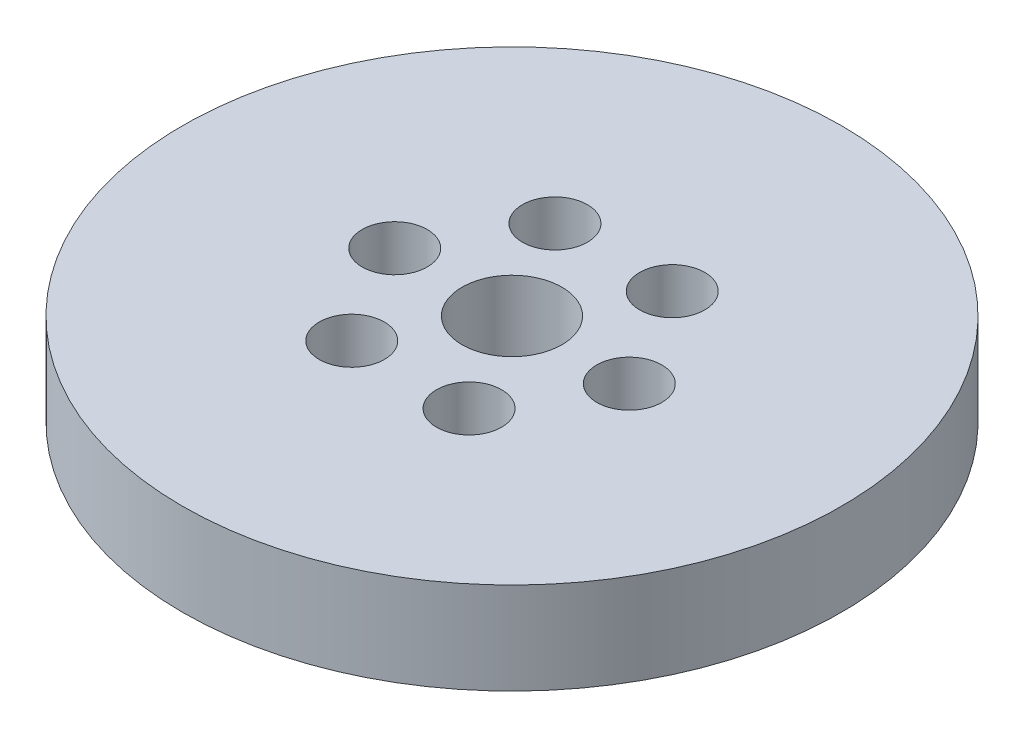
ISO-10303-21;
HEADER;
FILE_DESCRIPTION(('STEP AP214'),'2;1');
FILE_NAME('part.step','',(''),(''),'','','');
FILE_SCHEMA(('AUTOMOTIVE_DESIGN { 1 0 10303 214 1 1 1 1 }'));
ENDSEC;
DATA;
#1=APPLICATION_CONTEXT('core data for automotive mechanical design processes');
#2=APPLICATION_PROTOCOL_DEFINITION('international standard','automotive_design',2000,#1);
#3=PRODUCT_CONTEXT('',#1,'mechanical');
#4=PRODUCT('Part','Part','',(#3));
#5=PRODUCT_RELATED_PRODUCT_CATEGORY('part','',(#4));
#6=PRODUCT_DEFINITION_FORMATION('','',#4);
#7=PRODUCT_DEFINITION_CONTEXT('part definition',#1,'design');
#8=PRODUCT_DEFINITION('design','',#6,#7);
#9=PRODUCT_DEFINITION_SHAPE('','',#8);
#10=(LENGTH_UNIT() NAMED_UNIT(*) SI_UNIT(.MILLI.,.METRE.));
#11=(NAMED_UNIT(*) PLANE_ANGLE_UNIT() SI_UNIT($,.RADIAN.));
#12=(NAMED_UNIT(*) SI_UNIT($,.STERADIAN.) SOLID_ANGLE_UNIT());
#13=UNCERTAINTY_MEASURE_WITH_UNIT(LENGTH_MEASURE(1.E-05),#10,'distance_accuracy_value','');
#14=(GEOMETRIC_REPRESENTATION_CONTEXT(3) GLOBAL_UNCERTAINTY_ASSIGNED_CONTEXT((#13)) GLOBAL_UNIT_ASSIGNED_CONTEXT((#10,
#11,#12)) REPRESENTATION_CONTEXT('',''));
#15=CARTESIAN_POINT('',(0.,0.,0.));
#16=DIRECTION('',(0.,0.,1.));
#17=DIRECTION('',(1.,0.,0.));
#18=AXIS2_PLACEMENT_3D('',#15,#16,#17);
#19=CARTESIAN_POINT('',(0.,23.,0.));
#20=DIRECTION('',(0.,-1.,0.));
#21=DIRECTION('',(0.,0.,-1.));
#22=AXIS2_PLACEMENT_3D('',#19,#20,#21);
#23=CYLINDRICAL_SURFACE('',#22,82.5);
#24=CARTESIAN_POINT('',(0.,23.,0.));
#25=DIRECTION('',(0.,1.,0.));
#26=DIRECTION('',(0.,0.,1.));
#27=AXIS2_PLACEMENT_3D('',#24,#25,#26);
#28=CIRCLE('',#27,82.5);
#29=CARTESIAN_POINT('',(0.,23.,82.5));
#30=VERTEX_POINT('',#29);
#31=EDGE_CURVE('E10',#30,#30,#28,.T.);
#32=ORIENTED_EDGE('',*,*,#31,.F.);
#33=EDGE_LOOP('',(#32));
#34=FACE_BOUND('',#33,.T.);
#35=CARTESIAN_POINT('',(0.,0.,0.));
#36=DIRECTION('',(0.,1.,0.));
#37=DIRECTION('',(0.,0.,1.));
#38=AXIS2_PLACEMENT_3D('',#35,#36,#37);
#39=CIRCLE('',#38,82.5);
#40=CARTESIAN_POINT('',(0.,0.,82.5));
#41=VERTEX_POINT('',#40);
#42=EDGE_CURVE('E37',#41,#41,#39,.T.);
#43=ORIENTED_EDGE('',*,*,#42,.T.);
#44=EDGE_LOOP('',(#43));
#45=FACE_BOUND('',#44,.T.);
#46=ADVANCED_FACE('F40',(#34,#45),#23,.T.);
#47=CARTESIAN_POINT('',(0.,23.,0.));
#48=DIRECTION('',(0.,1.,0.));
#49=DIRECTION('',(0.,0.,1.));
#50=AXIS2_PLACEMENT_3D('',#47,#48,#49);
#51=PLANE('',#50);
#52=CARTESIAN_POINT('',(-14.6817229672217,23.,-25.4294901218782));
#53=DIRECTION('',(0.,1.,0.));
#54=DIRECTION('',(-0.866025403784433,0.,0.50000000000001));
#55=AXIS2_PLACEMENT_3D('',#52,#53,#54);
#56=CIRCLE('',#55,8.14547012890914);
#57=CARTESIAN_POINT('',(-21.7359070246243,23.,-21.3567550574236));
#58=VERTEX_POINT('',#57);
#59=EDGE_CURVE('E70',#58,#58,#56,.T.);
#60=ORIENTED_EDGE('',*,*,#59,.F.);
#61=EDGE_LOOP('',(#60));
#62=FACE_BOUND('',#61,.T.);
#63=CARTESIAN_POINT('',(14.6817229672212,23.,-25.4294901218785));
#64=DIRECTION('',(0.,1.,0.));
#65=DIRECTION('',(-0.866025403784443,0.,-0.499999999999992));
#66=AXIS2_PLACEMENT_3D('',#63,#64,#65);
#67=CIRCLE('',#66,8.14547012890914);
#68=CARTESIAN_POINT('',(7.62753890981853,23.,-29.502225186333));
#69=VERTEX_POINT('',#68);
#70=EDGE_CURVE('E71',#69,#69,#67,.T.);
#71=ORIENTED_EDGE('',*,*,#70,.F.);
#72=EDGE_LOOP('',(#71));
#73=FACE_BOUND('',#72,.T.);
#74=CARTESIAN_POINT('',(29.3634459344429,23.,0.));
#75=DIRECTION('',(0.,1.,0.));
#76=DIRECTION('',(0.,0.,-1.));
#77=AXIS2_PLACEMENT_3D('',#74,#75,#76);
#78=CIRCLE('',#77,8.14547012890914);
#79=CARTESIAN_POINT('',(29.3634459344429,23.,-8.14547012890914));
#80=VERTEX_POINT('',#79);
#81=EDGE_CURVE('E78',#80,#80,#78,.T.);
#82=ORIENTED_EDGE('',*,*,#81,.F.);
#83=EDGE_LOOP('',(#82));
#84=FACE_BOUND('',#83,.T.);
#85=CARTESIAN_POINT('',(14.6817229672215,23.,25.4294901218783));
#86=DIRECTION('',(0.,1.,0.));
#87=DIRECTION('',(0.866025403784436,0.,-0.500000000000004));
#88=AXIS2_PLACEMENT_3D('',#85,#86,#87);
#89=CIRCLE('',#88,8.14547012890914);
#90=CARTESIAN_POINT('',(21.7359070246242,23.,21.3567550574237));
#91=VERTEX_POINT('',#90);
#92=EDGE_CURVE('E84',#91,#91,#89,.T.);
#93=ORIENTED_EDGE('',*,*,#92,.F.);
#94=EDGE_LOOP('',(#93));
#95=FACE_BOUND('',#94,.T.);
#96=CARTESIAN_POINT('',(-14.6817229672214,23.,25.4294901218784));
#97=DIRECTION('',(0.,1.,0.));
#98=DIRECTION('',(0.86602540378444,0.,0.499999999999998));
#99=AXIS2_PLACEMENT_3D('',#96,#97,#98);
#100=CIRCLE('',#99,8.14547012890914);
#101=CARTESIAN_POINT('',(-7.62753890981874,23.,29.502225186333));
#102=VERTEX_POINT('',#101);
#103=EDGE_CURVE('E61',#102,#102,#100,.T.);
#104=ORIENTED_EDGE('',*,*,#103,.F.);
#105=EDGE_LOOP('',(#104));
#106=FACE_BOUND('',#105,.T.);
#107=CARTESIAN_POINT('',(-29.3634459344429,23.,0.));
#108=DIRECTION('',(0.,1.,0.));
#109=DIRECTION('',(0.,0.,1.));
#110=AXIS2_PLACEMENT_3D('',#107,#108,#109);
#111=CIRCLE('',#110,8.14547012890914);
#112=CARTESIAN_POINT('',(-29.3634459344429,23.,8.14547012890914));
#113=VERTEX_POINT('',#112);
#114=EDGE_CURVE('E54',#113,#113,#111,.T.);
#115=ORIENTED_EDGE('',*,*,#114,.F.);
#116=EDGE_LOOP('',(#115));
#117=FACE_BOUND('',#116,.T.);
#118=CARTESIAN_POINT('',(0.,23.,0.));
#119=DIRECTION('',(0.,1.,0.));
#120=DIRECTION('',(0.,0.,1.));
#121=AXIS2_PLACEMENT_3D('',#118,#119,#120);
#122=CIRCLE('',#121,12.5);
#123=CARTESIAN_POINT('',(0.,23.,12.5));
#124=VERTEX_POINT('',#123);
#125=EDGE_CURVE('E50',#124,#124,#122,.T.);
#126=ORIENTED_EDGE('',*,*,#125,.F.);
#127=EDGE_LOOP('',(#126));
#128=FACE_BOUND('',#127,.T.);
#129=ORIENTED_EDGE('',*,*,#31,.T.);
#130=EDGE_LOOP('',(#129));
#131=FACE_BOUND('',#130,.T.);
#132=ADVANCED_FACE('F99',(#62,#73,#84,#95,#106,#117,#128,#131),#51,.T.);
#133=CARTESIAN_POINT('',(0.,0.,0.));
#134=DIRECTION('',(0.,1.,0.));
#135=DIRECTION('',(0.,0.,1.));
#136=AXIS2_PLACEMENT_3D('',#133,#134,#135);
#137=PLANE('',#136);
#138=CARTESIAN_POINT('',(0.,0.,0.));
#139=DIRECTION('',(0.,1.,0.));
#140=DIRECTION('',(0.,0.,1.));
#141=AXIS2_PLACEMENT_3D('',#138,#139,#140);
#142=CIRCLE('',#141,12.5);
#143=CARTESIAN_POINT('',(0.,0.,12.5));
#144=VERTEX_POINT('',#143);
#145=EDGE_CURVE('E47',#144,#144,#142,.T.);
#146=ORIENTED_EDGE('',*,*,#145,.T.);
#147=EDGE_LOOP('',(#146));
#148=FACE_BOUND('',#147,.T.);
#149=ORIENTED_EDGE('',*,*,#42,.F.);
#150=EDGE_LOOP('',(#149));
#151=FACE_BOUND('',#150,.T.);
#152=ADVANCED_FACE('F103',(#148,#151),#137,.F.);
#153=CARTESIAN_POINT('',(0.,23.,0.));
#154=DIRECTION('',(0.,-1.,0.));
#155=DIRECTION('',(0.,0.,-1.));
#156=AXIS2_PLACEMENT_3D('',#153,#154,#155);
#157=CYLINDRICAL_SURFACE('',#156,12.5);
#158=ORIENTED_EDGE('',*,*,#125,.T.);
#159=EDGE_LOOP('',(#158));
#160=FACE_BOUND('',#159,.T.);
#161=ORIENTED_EDGE('',*,*,#145,.F.);
#162=EDGE_LOOP('',(#161));
#163=FACE_BOUND('',#162,.T.);
#164=ADVANCED_FACE('F115',(#160,#163),#157,.F.);
#165=CARTESIAN_POINT('',(-29.3634459344429,2.30068976757885,0.));
#166=DIRECTION('',(0.,1.,0.));
#167=DIRECTION('',(0.,0.,1.));
#168=AXIS2_PLACEMENT_3D('',#165,#166,#167);
#169=CYLINDRICAL_SURFACE('',#168,8.14547012890914);
#170=CARTESIAN_POINT('',(-29.3634459344429,2.30068976757885,0.));
#171=DIRECTION('',(0.,1.,0.));
#172=DIRECTION('',(0.,0.,1.));
#173=AXIS2_PLACEMENT_3D('',#170,#171,#172);
#174=CIRCLE('',#173,8.14547012890914);
#175=CARTESIAN_POINT('',(-29.3634459344429,2.30068976757885,8.14547012890914));
#176=VERTEX_POINT('',#175);
#177=EDGE_CURVE('E55',#176,#176,#174,.T.);
#178=ORIENTED_EDGE('',*,*,#177,.F.);
#179=EDGE_LOOP('',(#178));
#180=FACE_BOUND('',#179,.T.);
#181=ORIENTED_EDGE('',*,*,#114,.T.);
#182=EDGE_LOOP('',(#181));
#183=FACE_BOUND('',#182,.T.);
#184=ADVANCED_FACE('F113',(#180,#183),#169,.F.);
#185=CARTESIAN_POINT('',(-29.3634459344429,2.30068976757885,0.));
#186=DIRECTION('',(0.,1.,0.));
#187=DIRECTION('',(0.,0.,1.));
#188=AXIS2_PLACEMENT_3D('',#185,#186,#187);
#189=PLANE('',#188);
#190=ORIENTED_EDGE('',*,*,#177,.T.);
#191=EDGE_LOOP('',(#190));
#192=FACE_BOUND('',#191,.T.);
#193=ADVANCED_FACE('F144',(#192),#189,.T.);
#194=CARTESIAN_POINT('',(-14.6817229672214,2.30068976757885,25.4294901218784));
#195=DIRECTION('',(0.,1.,0.));
#196=DIRECTION('',(0.,0.,1.));
#197=AXIS2_PLACEMENT_3D('',#194,#195,#196);
#198=CYLINDRICAL_SURFACE('',#197,8.14547012890914);
#199=CARTESIAN_POINT('',(-14.6817229672214,2.30068976757885,25.4294901218784));
#200=DIRECTION('',(0.,1.,0.));
#201=DIRECTION('',(0.86602540378444,0.,0.499999999999998));
#202=AXIS2_PLACEMENT_3D('',#199,#200,#201);
#203=CIRCLE('',#202,8.14547012890914);
#204=CARTESIAN_POINT('',(-7.62753890981874,2.30068976757885,29.502225186333));
#205=VERTEX_POINT('',#204);
#206=EDGE_CURVE('E59',#205,#205,#203,.T.);
#207=ORIENTED_EDGE('',*,*,#206,.F.);
#208=EDGE_LOOP('',(#207));
#209=FACE_BOUND('',#208,.T.);
#210=ORIENTED_EDGE('',*,*,#103,.T.);
#211=EDGE_LOOP('',(#210));
#212=FACE_BOUND('',#211,.T.);
#213=ADVANCED_FACE('F153',(#209,#212),#198,.F.);
#214=CARTESIAN_POINT('',(-14.6817229672214,2.30068976757885,25.4294901218784));
#215=DIRECTION('',(0.,1.,0.));
#216=DIRECTION('',(0.86602540378444,0.,0.499999999999998));
#217=AXIS2_PLACEMENT_3D('',#214,#215,#216);
#218=PLANE('',#217);
#219=ORIENTED_EDGE('',*,*,#206,.T.);
#220=EDGE_LOOP('',(#219));
#221=FACE_BOUND('',#220,.T.);
#222=ADVANCED_FACE('F96',(#221),#218,.T.);
#223=CARTESIAN_POINT('',(14.6817229672215,2.30068976757885,25.4294901218783));
#224=DIRECTION('',(0.,1.,0.));
#225=DIRECTION('',(0.,0.,1.));
#226=AXIS2_PLACEMENT_3D('',#223,#224,#225);
#227=CYLINDRICAL_SURFACE('',#226,8.14547012890914);
#228=CARTESIAN_POINT('',(14.6817229672215,2.30068976757885,25.4294901218783));
#229=DIRECTION('',(0.,1.,0.));
#230=DIRECTION('',(0.866025403784436,0.,-0.500000000000004));
#231=AXIS2_PLACEMENT_3D('',#228,#229,#230);
#232=CIRCLE('',#231,8.14547012890914);
#233=CARTESIAN_POINT('',(21.7359070246242,2.30068976757885,21.3567550574237));
#234=VERTEX_POINT('',#233);
#235=EDGE_CURVE('E63',#234,#234,#232,.T.);
#236=ORIENTED_EDGE('',*,*,#235,.F.);
#237=EDGE_LOOP('',(#236));
#238=FACE_BOUND('',#237,.T.);
#239=ORIENTED_EDGE('',*,*,#92,.T.);
#240=EDGE_LOOP('',(#239));
#241=FACE_BOUND('',#240,.T.);
#242=ADVANCED_FACE('F91',(#238,#241),#227,.F.);
#243=CARTESIAN_POINT('',(14.6817229672215,2.30068976757885,25.4294901218783));
#244=DIRECTION('',(0.,1.,0.));
#245=DIRECTION('',(0.866025403784436,0.,-0.500000000000004));
#246=AXIS2_PLACEMENT_3D('',#243,#244,#245);
#247=PLANE('',#246);
#248=ORIENTED_EDGE('',*,*,#235,.T.);
#249=EDGE_LOOP('',(#248));
#250=FACE_BOUND('',#249,.T.);
#251=ADVANCED_FACE('F93',(#250),#247,.T.);
#252=CARTESIAN_POINT('',(29.3634459344429,2.30068976757885,0.));
#253=DIRECTION('',(0.,1.,0.));
#254=DIRECTION('',(0.,0.,1.));
#255=AXIS2_PLACEMENT_3D('',#252,#253,#254);
#256=CYLINDRICAL_SURFACE('',#255,8.14547012890914);
#257=CARTESIAN_POINT('',(29.3634459344429,2.30068976757885,0.));
#258=DIRECTION('',(0.,1.,0.));
#259=DIRECTION('',(0.,0.,-1.));
#260=AXIS2_PLACEMENT_3D('',#257,#258,#259);
#261=CIRCLE('',#260,8.14547012890914);
#262=CARTESIAN_POINT('',(29.3634459344429,2.30068976757885,-8.14547012890914));
#263=VERTEX_POINT('',#262);
#264=EDGE_CURVE('E85',#263,#263,#261,.T.);
#265=ORIENTED_EDGE('',*,*,#264,.F.);
#266=EDGE_LOOP('',(#265));
#267=FACE_BOUND('',#266,.T.);
#268=ORIENTED_EDGE('',*,*,#81,.T.);
#269=EDGE_LOOP('',(#268));
#270=FACE_BOUND('',#269,.T.);
#271=ADVANCED_FACE('F187',(#267,#270),#256,.F.);
#272=CARTESIAN_POINT('',(29.3634459344429,2.30068976757885,0.));
#273=DIRECTION('',(0.,1.,0.));
#274=DIRECTION('',(0.,0.,-1.));
#275=AXIS2_PLACEMENT_3D('',#272,#273,#274);
#276=PLANE('',#275);
#277=ORIENTED_EDGE('',*,*,#264,.T.);
#278=EDGE_LOOP('',(#277));
#279=FACE_BOUND('',#278,.T.);
#280=ADVANCED_FACE('F198',(#279),#276,.T.);
#281=CARTESIAN_POINT('',(14.6817229672212,2.30068976757885,-25.4294901218785));
#282=DIRECTION('',(0.,1.,0.));
#283=DIRECTION('',(0.,0.,1.));
#284=AXIS2_PLACEMENT_3D('',#281,#282,#283);
#285=CYLINDRICAL_SURFACE('',#284,8.14547012890914);
#286=CARTESIAN_POINT('',(14.6817229672212,2.30068976757885,-25.4294901218785));
#287=DIRECTION('',(0.,1.,0.));
#288=DIRECTION('',(-0.866025403784443,0.,-0.499999999999992));
#289=AXIS2_PLACEMENT_3D('',#286,#287,#288);
#290=CIRCLE('',#289,8.14547012890914);
#291=CARTESIAN_POINT('',(7.62753890981853,2.30068976757885,-29.502225186333));
#292=VERTEX_POINT('',#291);
#293=EDGE_CURVE('E76',#292,#292,#290,.T.);
#294=ORIENTED_EDGE('',*,*,#293,.F.);
#295=EDGE_LOOP('',(#294));
#296=FACE_BOUND('',#295,.T.);
#297=ORIENTED_EDGE('',*,*,#70,.T.);
#298=EDGE_LOOP('',(#297));
#299=FACE_BOUND('',#298,.T.);
#300=ADVANCED_FACE('F202',(#296,#299),#285,.F.);
#301=CARTESIAN_POINT('',(14.6817229672212,2.30068976757885,-25.4294901218785));
#302=DIRECTION('',(0.,1.,0.));
#303=DIRECTION('',(-0.866025403784443,0.,-0.499999999999992));
#304=AXIS2_PLACEMENT_3D('',#301,#302,#303);
#305=PLANE('',#304);
#306=ORIENTED_EDGE('',*,*,#293,.T.);
#307=EDGE_LOOP('',(#306));
#308=FACE_BOUND('',#307,.T.);
#309=ADVANCED_FACE('F212',(#308),#305,.T.);
#310=CARTESIAN_POINT('',(-14.6817229672217,2.30068976757885,-25.4294901218782));
#311=DIRECTION('',(0.,1.,0.));
#312=DIRECTION('',(0.,0.,1.));
#313=AXIS2_PLACEMENT_3D('',#310,#311,#312);
#314=CYLINDRICAL_SURFACE('',#313,8.14547012890914);
#315=CARTESIAN_POINT('',(-14.6817229672217,2.30068976757885,-25.4294901218782));
#316=DIRECTION('',(0.,1.,0.));
#317=DIRECTION('',(-0.866025403784433,0.,0.50000000000001));
#318=AXIS2_PLACEMENT_3D('',#315,#316,#317);
#319=CIRCLE('',#318,8.14547012890914);
#320=CARTESIAN_POINT('',(-21.7359070246243,2.30068976757885,-21.3567550574236));
#321=VERTEX_POINT('',#320);
#322=EDGE_CURVE('E69',#321,#321,#319,.T.);
#323=ORIENTED_EDGE('',*,*,#322,.F.);
#324=EDGE_LOOP('',(#323));
#325=FACE_BOUND('',#324,.T.);
#326=ORIENTED_EDGE('',*,*,#59,.T.);
#327=EDGE_LOOP('',(#326));
#328=FACE_BOUND('',#327,.T.);
#329=ADVANCED_FACE('F224',(#325,#328),#314,.F.);
#330=CARTESIAN_POINT('',(-14.6817229672217,2.30068976757885,-25.4294901218782));
#331=DIRECTION('',(0.,1.,0.));
#332=DIRECTION('',(-0.866025403784433,0.,0.50000000000001));
#333=AXIS2_PLACEMENT_3D('',#330,#331,#332);
#334=PLANE('',#333);
#335=ORIENTED_EDGE('',*,*,#322,.T.);
#336=EDGE_LOOP('',(#335));
#337=FACE_BOUND('',#336,.T.);
#338=ADVANCED_FACE('F235',(#337),#334,.T.);
#339=CLOSED_SHELL('',(#46,#132,#152,#164,#184,#193,#213,#222,#242,#251,#271,#280,#300,#309,#329,#338));
#340=MANIFOLD_SOLID_BREP('B2',#339);
#341=ADVANCED_BREP_SHAPE_REPRESENTATION('',(#18,#340),#14);
#342=SHAPE_DEFINITION_REPRESENTATION(#9,#341);
ENDSEC;
END-ISO-10303-21;
